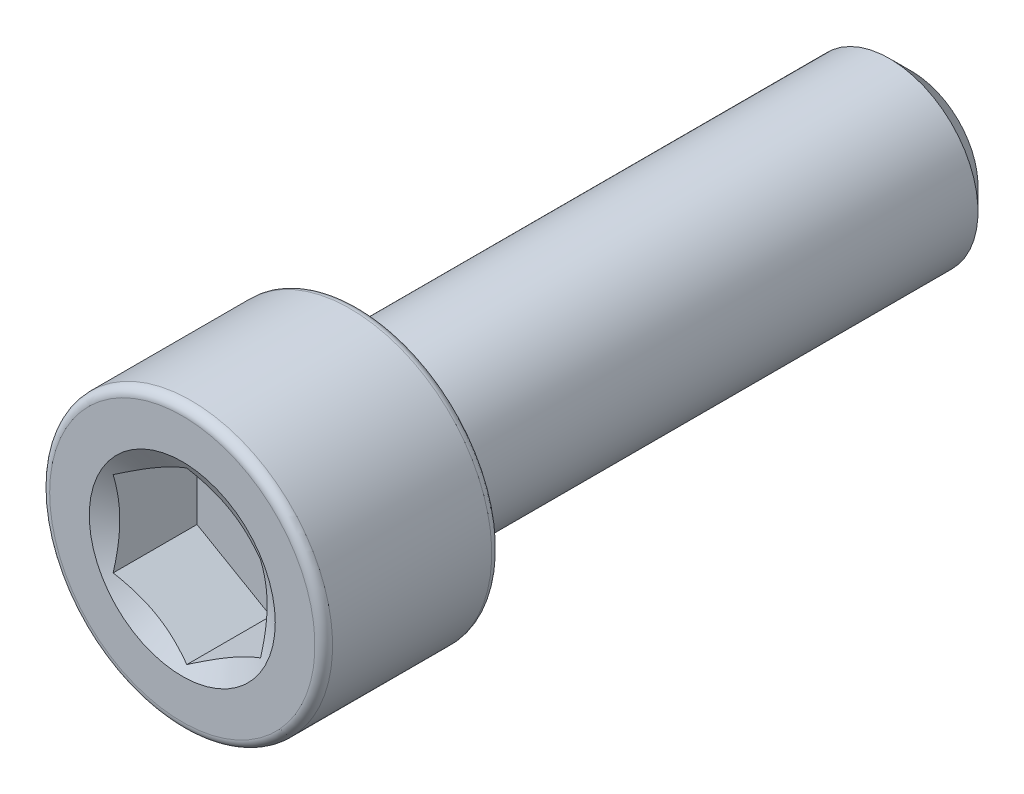
ISO-10303-21;
HEADER;
FILE_DESCRIPTION(('STEP AP214'),'2;1');
FILE_NAME('part.step','',(''),(''),'','','');
FILE_SCHEMA(('AUTOMOTIVE_DESIGN { 1 0 10303 214 1 1 1 1 }'));
ENDSEC;
DATA;
#1=APPLICATION_CONTEXT('core data for automotive mechanical design processes');
#2=APPLICATION_PROTOCOL_DEFINITION('international standard','automotive_design',2000,#1);
#3=PRODUCT_CONTEXT('',#1,'mechanical');
#4=PRODUCT('Part','Part','',(#3));
#5=PRODUCT_RELATED_PRODUCT_CATEGORY('part','',(#4));
#6=PRODUCT_DEFINITION_FORMATION('','',#4);
#7=PRODUCT_DEFINITION_CONTEXT('part definition',#1,'design');
#8=PRODUCT_DEFINITION('design','',#6,#7);
#9=PRODUCT_DEFINITION_SHAPE('','',#8);
#10=(LENGTH_UNIT() NAMED_UNIT(*) SI_UNIT(.MILLI.,.METRE.));
#11=(NAMED_UNIT(*) PLANE_ANGLE_UNIT() SI_UNIT($,.RADIAN.));
#12=(NAMED_UNIT(*) SI_UNIT($,.STERADIAN.) SOLID_ANGLE_UNIT());
#13=UNCERTAINTY_MEASURE_WITH_UNIT(LENGTH_MEASURE(1.E-05),#10,'distance_accuracy_value','');
#14=(GEOMETRIC_REPRESENTATION_CONTEXT(3) GLOBAL_UNCERTAINTY_ASSIGNED_CONTEXT((#13)) GLOBAL_UNIT_ASSIGNED_CONTEXT((#10,
#11,#12)) REPRESENTATION_CONTEXT('',''));
#15=CARTESIAN_POINT('',(0.,0.,0.));
#16=DIRECTION('',(0.,0.,1.));
#17=DIRECTION('',(1.,0.,0.));
#18=AXIS2_PLACEMENT_3D('',#15,#16,#17);
#19=CARTESIAN_POINT('',(0.,0.,-3.14325));
#20=DIRECTION('',(0.,0.,-1.));
#21=DIRECTION('',(-1.,0.,0.));
#22=AXIS2_PLACEMENT_3D('',#19,#20,#21);
#23=PLANE('',#22);
#24=CARTESIAN_POINT('',(0.,0.,-3.14325));
#25=DIRECTION('',(0.,0.,-1.));
#26=DIRECTION('',(-1.,0.,0.));
#27=AXIS2_PLACEMENT_3D('',#24,#25,#26);
#28=CIRCLE('',#27,0.571500000000006);
#29=CARTESIAN_POINT('',(-0.571500000000006,0.,-3.14325));
#30=VERTEX_POINT('',#29);
#31=EDGE_CURVE('E57',#30,#30,#28,.T.);
#32=ORIENTED_EDGE('',*,*,#31,.T.);
#33=EDGE_LOOP('',(#32));
#34=FACE_BOUND('',#33,.T.);
#35=ADVANCED_FACE('F43',(#34),#23,.T.);
#36=CARTESIAN_POINT('',(0.,0.,-3.14325));
#37=DIRECTION('',(0.,0.,1.));
#38=DIRECTION('',(1.,0.,0.));
#39=AXIS2_PLACEMENT_3D('',#36,#37,#38);
#40=CONICAL_SURFACE('',#39,0.571500000000006,0.785398163397453);
#41=CARTESIAN_POINT('',(0.,0.,-2.95275));
#42=DIRECTION('',(0.,0.,-1.));
#43=DIRECTION('',(-1.,0.,0.));
#44=AXIS2_PLACEMENT_3D('',#41,#42,#43);
#45=CIRCLE('',#44,0.762000000000007);
#46=CARTESIAN_POINT('',(-0.762000000000007,0.,-2.95275));
#47=VERTEX_POINT('',#46);
#48=EDGE_CURVE('E151',#47,#47,#45,.T.);
#49=ORIENTED_EDGE('',*,*,#48,.T.);
#50=EDGE_LOOP('',(#49));
#51=FACE_BOUND('',#50,.T.);
#52=ORIENTED_EDGE('',*,*,#31,.F.);
#53=EDGE_LOOP('',(#52));
#54=FACE_BOUND('',#53,.T.);
#55=ADVANCED_FACE('F159',(#51,#54),#40,.T.);
#56=CARTESIAN_POINT('',(0.,0.,-3.14325));
#57=DIRECTION('',(0.,0.,-1.));
#58=DIRECTION('',(-1.,0.,0.));
#59=AXIS2_PLACEMENT_3D('',#56,#57,#58);
#60=CYLINDRICAL_SURFACE('',#59,0.762000000000007);
#61=CARTESIAN_POINT('',(0.,0.,1.61925));
#62=DIRECTION('',(0.,0.,-1.));
#63=DIRECTION('',(-1.,0.,0.));
#64=AXIS2_PLACEMENT_3D('',#61,#62,#63);
#65=CIRCLE('',#64,0.762000000000007);
#66=CARTESIAN_POINT('',(-0.762000000000007,0.,1.61925));
#67=VERTEX_POINT('',#66);
#68=EDGE_CURVE('E147',#67,#67,#65,.T.);
#69=ORIENTED_EDGE('',*,*,#68,.T.);
#70=EDGE_LOOP('',(#69));
#71=FACE_BOUND('',#70,.T.);
#72=ORIENTED_EDGE('',*,*,#48,.F.);
#73=EDGE_LOOP('',(#72));
#74=FACE_BOUND('',#73,.T.);
#75=ADVANCED_FACE('F161',(#71,#74),#60,.T.);
#76=CARTESIAN_POINT('',(0.,0.762000000000004,1.61925));
#77=DIRECTION('',(0.,0.,-1.));
#78=DIRECTION('',(-1.,0.,0.));
#79=AXIS2_PLACEMENT_3D('',#76,#77,#78);
#80=PLANE('',#79);
#81=CARTESIAN_POINT('',(0.,0.,1.61925));
#82=DIRECTION('',(0.,0.,-1.));
#83=DIRECTION('',(-1.,0.,0.));
#84=AXIS2_PLACEMENT_3D('',#81,#82,#83);
#85=CIRCLE('',#84,1.143);
#86=CARTESIAN_POINT('',(-1.143,0.,1.61925));
#87=VERTEX_POINT('',#86);
#88=EDGE_CURVE('E143',#87,#87,#85,.T.);
#89=ORIENTED_EDGE('',*,*,#88,.T.);
#90=EDGE_LOOP('',(#89));
#91=FACE_BOUND('',#90,.T.);
#92=ORIENTED_EDGE('',*,*,#68,.F.);
#93=EDGE_LOOP('',(#92));
#94=FACE_BOUND('',#93,.T.);
#95=ADVANCED_FACE('F168',(#91,#94),#80,.T.);
#96=CARTESIAN_POINT('',(0.,0.,1.69545));
#97=DIRECTION('',(0.,0.,-1.));
#98=DIRECTION('',(-1.,0.,0.));
#99=AXIS2_PLACEMENT_3D('',#96,#97,#98);
#100=TOROIDAL_SURFACE('',#99,1.143,0.0762000000000002);
#101=CARTESIAN_POINT('',(0.,0.,1.69545));
#102=DIRECTION('',(0.,0.,-1.));
#103=DIRECTION('',(-1.,0.,0.));
#104=AXIS2_PLACEMENT_3D('',#101,#102,#103);
#105=CIRCLE('',#104,1.2192);
#106=CARTESIAN_POINT('',(-1.2192,0.,1.69545));
#107=VERTEX_POINT('',#106);
#108=EDGE_CURVE('E139',#107,#107,#105,.T.);
#109=ORIENTED_EDGE('',*,*,#108,.T.);
#110=EDGE_LOOP('',(#109));
#111=FACE_BOUND('',#110,.T.);
#112=ORIENTED_EDGE('',*,*,#88,.F.);
#113=EDGE_LOOP('',(#112));
#114=FACE_BOUND('',#113,.T.);
#115=ADVANCED_FACE('F174',(#111,#114),#100,.T.);
#116=CARTESIAN_POINT('',(0.,0.,-3.14325));
#117=DIRECTION('',(0.,0.,-1.));
#118=DIRECTION('',(-1.,0.,0.));
#119=AXIS2_PLACEMENT_3D('',#116,#117,#118);
#120=CYLINDRICAL_SURFACE('',#119,1.2192);
#121=CARTESIAN_POINT('',(0.,0.,3.06705));
#122=DIRECTION('',(0.,0.,-1.));
#123=DIRECTION('',(-1.,0.,0.));
#124=AXIS2_PLACEMENT_3D('',#121,#122,#123);
#125=CIRCLE('',#124,1.2192);
#126=CARTESIAN_POINT('',(-1.2192,0.,3.06705));
#127=VERTEX_POINT('',#126);
#128=EDGE_CURVE('E135',#127,#127,#125,.T.);
#129=ORIENTED_EDGE('',*,*,#128,.T.);
#130=EDGE_LOOP('',(#129));
#131=FACE_BOUND('',#130,.T.);
#132=ORIENTED_EDGE('',*,*,#108,.F.);
#133=EDGE_LOOP('',(#132));
#134=FACE_BOUND('',#133,.T.);
#135=ADVANCED_FACE('F178',(#131,#134),#120,.T.);
#136=CARTESIAN_POINT('',(0.,0.,3.06705));
#137=DIRECTION('',(0.,0.,-1.));
#138=DIRECTION('',(-1.,0.,0.));
#139=AXIS2_PLACEMENT_3D('',#136,#137,#138);
#140=TOROIDAL_SURFACE('',#139,1.143,0.0761999999999994);
#141=CARTESIAN_POINT('',(0.,0.,3.14325));
#142=DIRECTION('',(0.,0.,-1.));
#143=DIRECTION('',(-1.,0.,0.));
#144=AXIS2_PLACEMENT_3D('',#141,#142,#143);
#145=CIRCLE('',#144,1.143);
#146=CARTESIAN_POINT('',(-1.143,0.,3.14325));
#147=VERTEX_POINT('',#146);
#148=EDGE_CURVE('E131',#147,#147,#145,.T.);
#149=ORIENTED_EDGE('',*,*,#148,.T.);
#150=EDGE_LOOP('',(#149));
#151=FACE_BOUND('',#150,.T.);
#152=ORIENTED_EDGE('',*,*,#128,.F.);
#153=EDGE_LOOP('',(#152));
#154=FACE_BOUND('',#153,.T.);
#155=ADVANCED_FACE('F182',(#151,#154),#140,.T.);
#156=CARTESIAN_POINT('',(0.,1.143,3.14325));
#157=DIRECTION('',(0.,0.,1.));
#158=DIRECTION('',(1.,0.,0.));
#159=AXIS2_PLACEMENT_3D('',#156,#157,#158);
#160=PLANE('',#159);
#161=CARTESIAN_POINT('',(0.,0.,3.14325));
#162=DIRECTION('',(0.,0.,1.));
#163=DIRECTION('',(1.,0.,0.));
#164=AXIS2_PLACEMENT_3D('',#161,#162,#163);
#165=CIRCLE('',#164,0.80152903489235);
#166=CARTESIAN_POINT('',(0.80152903489235,0.,3.14325));
#167=VERTEX_POINT('',#166);
#168=EDGE_CURVE('E290',#167,#167,#165,.T.);
#169=ORIENTED_EDGE('',*,*,#168,.F.);
#170=EDGE_LOOP('',(#169));
#171=FACE_BOUND('',#170,.T.);
#172=ORIENTED_EDGE('',*,*,#148,.F.);
#173=EDGE_LOOP('',(#172));
#174=FACE_BOUND('',#173,.T.);
#175=ADVANCED_FACE('F186',(#171,#174),#160,.T.);
#176=CARTESIAN_POINT('',(0.,0.,3.14325));
#177=DIRECTION('',(0.,0.,1.));
#178=DIRECTION('',(1.,0.,0.));
#179=AXIS2_PLACEMENT_3D('',#176,#177,#178);
#180=CONICAL_SURFACE('',#179,0.80152903489235,1.0471975511966);
#181=ORIENTED_EDGE('',*,*,#168,.T.);
#182=EDGE_LOOP('',(#181));
#183=FACE_BOUND('',#182,.T.);
#184=CARTESIAN_POINT('',(0.635199999999996,0.366501950881572,3.10388701168715));
#185=CARTESIAN_POINT('',(0.607292219657765,0.382614515374644,3.09457737100847));
#186=CARTESIAN_POINT('',(0.579143547529669,0.398866158805131,3.08610990429231));
#187=CARTESIAN_POINT('',(0.522358552704207,0.431650990853543,3.07132827647694));
#188=CARTESIAN_POINT('',(0.493721219336989,0.448184762981979,3.06501934730768));
#189=CARTESIAN_POINT('',(0.436801541446144,0.481047354334446,3.05519641810381));
#190=CARTESIAN_POINT('',(0.408527966055241,0.497371110697337,3.05161707793994));
#191=CARTESIAN_POINT('',(0.351847454758901,0.530095619152084,3.04734034979042));
#192=CARTESIAN_POINT('',(0.323440725531533,0.546496251918302,3.04663942426613));
#193=CARTESIAN_POINT('',(0.270330144468172,0.577159660192051,3.04808054129889));
#194=CARTESIAN_POINT('',(0.245618453518768,0.59142696161382,3.04986963645016));
#195=CARTESIAN_POINT('',(0.196374723541005,0.619857842372383,3.05554348317702));
#196=CARTESIAN_POINT('',(0.17184271734793,0.634021402751717,3.05942860854846));
#197=CARTESIAN_POINT('',(0.122506087540727,0.662505919251814,3.06914421243503));
#198=CARTESIAN_POINT('',(0.0977078290775989,0.676823200450935,3.07501666381184));
#199=CARTESIAN_POINT('',(0.0484816480053033,0.705243949344202,3.08834563129952));
#200=CARTESIAN_POINT('',(0.0240530923717906,0.719347782515125,3.09579900576742));
#201=CARTESIAN_POINT('',(-0.000200000000000831,0.733350311924659,3.10388701168715));
#202=B_SPLINE_CURVE_WITH_KNOTS('',3,(#184,#185,#186,#187,#188,#189,#190,#191,#192,#193,#194,
#195,#196,#197,#198,#199,#200,#201),.UNSPECIFIED.,.F.,.F.,(4,2,2,2,2,2,2,2,4),(0.,
0.100668399227339,0.201579101133731,0.299991033708959,0.398281982883151,0.483972077511034,
0.569677458748181,0.657319406154946,0.744788794625029),.UNSPECIFIED.);
#203=CARTESIAN_POINT('',(0.634999999999996,0.36661742093541,3.10382032927493));
#204=VERTEX_POINT('',#203);
#205=CARTESIAN_POINT('',(0.,0.733234841870821,3.10382032927493));
#206=VERTEX_POINT('',#205);
#207=EDGE_CURVE('E112',#204,#206,#202,.T.);
#208=ORIENTED_EDGE('',*,*,#207,.F.);
#209=CARTESIAN_POINT('',(0.634999999999996,-0.959097963112756,3.34458887137113));
#210=CARTESIAN_POINT('',(0.634999999999996,-0.931556679772268,3.33133288640638));
#211=CARTESIAN_POINT('',(0.634999999999996,-0.903949682605684,3.31821404780037));
#212=CARTESIAN_POINT('',(0.634999999999996,-0.848568245938541,3.29232241272994));
#213=CARTESIAN_POINT('',(0.634999999999996,-0.820793778244026,3.27954967664044));
#214=CARTESIAN_POINT('',(0.634999999999996,-0.736852988216084,3.24171797820004));
#215=CARTESIAN_POINT('',(0.634999999999996,-0.680391212596161,3.21730259930656));
#216=CARTESIAN_POINT('',(0.634999999999996,-0.564791122147835,3.17053996650527));
#217=CARTESIAN_POINT('',(0.634999999999996,-0.505621907681889,3.14826809758868));
#218=CARTESIAN_POINT('',(0.634999999999996,-0.385762189538681,3.1085231285872));
#219=CARTESIAN_POINT('',(0.634999999999996,-0.32507598228835,3.09103785327421));
#220=CARTESIAN_POINT('',(0.634999999999996,-0.23288430895413,3.07064278157229));
#221=CARTESIAN_POINT('',(0.634999999999996,-0.202030496197413,3.06482313217936));
#222=CARTESIAN_POINT('',(0.634999999999996,-0.139966950698752,3.05550634370196));
#223=CARTESIAN_POINT('',(0.634999999999996,-0.108757245471978,3.05200902629248));
#224=CARTESIAN_POINT('',(0.634999999999996,-0.0465339716075323,3.04766092799307));
#225=CARTESIAN_POINT('',(0.634999999999996,-0.0155226986376008,3.04677818467235));
#226=CARTESIAN_POINT('',(0.634999999999996,0.0464618478782128,3.04764819847805));
#227=CARTESIAN_POINT('',(0.634999999999996,0.0774351191960265,3.04940110337632));
#228=CARTESIAN_POINT('',(0.634999999999996,0.15331354471637,3.05676925154506));
#229=CARTESIAN_POINT('',(0.634999999999996,0.198082738302702,3.06378881381357));
#230=CARTESIAN_POINT('',(0.634999999999996,0.286762922650733,3.08203660362331));
#231=CARTESIAN_POINT('',(0.634999999999996,0.330672833400381,3.09326980933956));
#232=CARTESIAN_POINT('',(0.634999999999996,0.418574152667773,3.11903064980441));
#233=CARTESIAN_POINT('',(0.634999999999996,0.462544834049434,3.1336272080306));
#234=CARTESIAN_POINT('',(0.634999999999996,0.549675691693248,3.1649839540635));
#235=CARTESIAN_POINT('',(0.634999999999996,0.592836129832992,3.18174342850941));
#236=CARTESIAN_POINT('',(0.634999999999996,0.704311907635469,3.22726790844175));
#237=CARTESIAN_POINT('',(0.634999999999996,0.772148908745404,3.25719261535732));
#238=CARTESIAN_POINT('',(0.634999999999996,0.906823028330444,3.31921638383651));
#239=CARTESIAN_POINT('',(0.634999999999996,0.973659853784011,3.35131606794592));
#240=CARTESIAN_POINT('',(0.634999999999996,1.10674887456329,3.41690114886722));
#241=CARTESIAN_POINT('',(0.634999999999996,1.17300025710097,3.45038818857521));
#242=CARTESIAN_POINT('',(0.634999999999996,1.30505288297791,3.51823909978659));
#243=CARTESIAN_POINT('',(0.634999999999996,1.37085411045543,3.55260300198752));
#244=CARTESIAN_POINT('',(0.634999999999996,1.49574396602631,3.61855305353702));
#245=CARTESIAN_POINT('',(0.634999999999996,1.55486199449233,3.65008364721893));
#246=CARTESIAN_POINT('',(0.634999999999996,1.67290744925443,3.71350493414473));
#247=CARTESIAN_POINT('',(0.634999999999996,1.73183486761611,3.74539564213689));
#248=CARTESIAN_POINT('',(0.634999999999996,1.84938435294178,3.80935979658298));
#249=CARTESIAN_POINT('',(0.634999999999996,1.90800681480962,3.84143251816496));
#250=CARTESIAN_POINT('',(0.634999999999996,2.02513313038202,3.90578607052732));
#251=CARTESIAN_POINT('',(0.634999999999996,2.08363699060363,3.93806688944181));
#252=CARTESIAN_POINT('',(0.634999999999996,2.14209846807494,3.97042379632227));
#253=B_SPLINE_CURVE_WITH_KNOTS('',3,(#209,#210,#211,#212,#213,#214,#215,#216,#217,#218,#219,
#220,#221,#222,#223,#224,#225,#226,#227,#228,#229,#230,#231,#232,#233,#234,#235,#236,#237,#238,
#239,#240,#241,#242,#243,#244,#245,#246,#247,#248,#249,#250,#251,#252),.UNSPECIFIED.,.F.,.F.,(4,
2,2,2,2,2,2,2,2,2,2,2,2,2,2,2,2,2,2,2,2,4),(0.,0.0916947477036917,0.183405389195738,
0.367900985352525,0.557472775250362,0.746557790750754,0.84067915588981,0.934793292890921,
1.02775206288416,1.12071604495472,1.25638390103958,1.39221254825033,1.53112100835765,
1.66998377098744,1.892338586175,2.11475731727005,2.33744741687164,2.56014532321701,
2.76114638746783,2.96215571366433,3.16262288404548,3.36307872298072),.UNSPECIFIED.);
#254=CARTESIAN_POINT('',(0.634999999999996,-0.36661742093541,3.10382032927493));
#255=VERTEX_POINT('',#254);
#256=EDGE_CURVE('E232',#255,#204,#253,.T.);
#257=ORIENTED_EDGE('',*,*,#256,.F.);
#258=CARTESIAN_POINT('',(-0.000200000000001787,-0.733350311924659,3.10388701168715));
#259=CARTESIAN_POINT('',(0.0277077803422287,-0.717237747431588,3.09457737100847));
#260=CARTESIAN_POINT('',(0.0558564524703254,-0.700986104001101,3.08610990429231));
#261=CARTESIAN_POINT('',(0.112641447295787,-0.668201271952689,3.07132827647694));
#262=CARTESIAN_POINT('',(0.141278780663005,-0.651667499824252,3.06501934730768));
#263=CARTESIAN_POINT('',(0.19819845855385,-0.618804908471786,3.05519641810381));
#264=CARTESIAN_POINT('',(0.226472033944753,-0.602481152108895,3.05161707793994));
#265=CARTESIAN_POINT('',(0.283152545241094,-0.569756643654147,3.04734034979042));
#266=CARTESIAN_POINT('',(0.311559274468462,-0.553356010887929,3.04663942426613));
#267=CARTESIAN_POINT('',(0.364669855531822,-0.522692602614181,3.04808054129889));
#268=CARTESIAN_POINT('',(0.389381546481227,-0.508425301192411,3.04986963645016));
#269=CARTESIAN_POINT('',(0.43862527645899,-0.479994420433849,3.05554348317702));
#270=CARTESIAN_POINT('',(0.463157282652065,-0.465830860054515,3.05942860854846));
#271=CARTESIAN_POINT('',(0.512493912459268,-0.437346343554417,3.06914421243503));
#272=CARTESIAN_POINT('',(0.537292170922396,-0.423029062355296,3.07501666381184));
#273=CARTESIAN_POINT('',(0.586518351994692,-0.394608313462029,3.08834563129952));
#274=CARTESIAN_POINT('',(0.610946907628204,-0.380504480291107,3.09579900576742));
#275=CARTESIAN_POINT('',(0.635199999999996,-0.366501950881572,3.10388701168715));
#276=B_SPLINE_CURVE_WITH_KNOTS('',3,(#258,#259,#260,#261,#262,#263,#264,#265,#266,#267,#268,
#269,#270,#271,#272,#273,#274,#275),.UNSPECIFIED.,.F.,.F.,(4,2,2,2,2,2,2,2,4),(0.,
0.100668399227339,0.201579101133732,0.29999103370896,0.398281982883151,0.483972077511035,
0.569677458748182,0.657319406154947,0.74478879462503),.UNSPECIFIED.);
#277=CARTESIAN_POINT('',(0.,-0.733234841870821,3.10382032927493));
#278=VERTEX_POINT('',#277);
#279=EDGE_CURVE('E226',#278,#255,#276,.T.);
#280=ORIENTED_EDGE('',*,*,#279,.F.);
#281=CARTESIAN_POINT('',(-0.635199999999997,-0.366501950881574,3.10388701168715));
#282=CARTESIAN_POINT('',(-0.607292219657766,-0.382614515374645,3.09457737100847));
#283=CARTESIAN_POINT('',(-0.57914354752967,-0.398866158805133,3.08610990429231));
#284=CARTESIAN_POINT('',(-0.522358552704208,-0.431650990853544,3.07132827647694));
#285=CARTESIAN_POINT('',(-0.49372121933699,-0.448184762981981,3.06501934730768));
#286=CARTESIAN_POINT('',(-0.436801541446145,-0.481047354334447,3.05519641810381));
#287=CARTESIAN_POINT('',(-0.408527966055242,-0.497371110697338,3.05161707793994));
#288=CARTESIAN_POINT('',(-0.351847454758901,-0.530095619152086,3.04734034979043));
#289=CARTESIAN_POINT('',(-0.323440725531533,-0.546496251918304,3.04663942426614));
#290=CARTESIAN_POINT('',(-0.270330144468173,-0.577159660192052,3.04808054129889));
#291=CARTESIAN_POINT('',(-0.245618453518768,-0.591426961613822,3.04986963645016));
#292=CARTESIAN_POINT('',(-0.196374723541006,-0.619857842372384,3.05554348317702));
#293=CARTESIAN_POINT('',(-0.171842717347931,-0.634021402751717,3.05942860854846));
#294=CARTESIAN_POINT('',(-0.122506087540729,-0.662505919251815,3.06914421243503));
#295=CARTESIAN_POINT('',(-0.0977078290776008,-0.676823200450936,3.07501666381184));
#296=CARTESIAN_POINT('',(-0.0484816480053055,-0.705243949344203,3.08834563129952));
#297=CARTESIAN_POINT('',(-0.0240530923717929,-0.719347782515125,3.09579900576742));
#298=CARTESIAN_POINT('',(0.00019999999999821,-0.733350311924659,3.10388701168715));
#299=B_SPLINE_CURVE_WITH_KNOTS('',3,(#281,#282,#283,#284,#285,#286,#287,#288,#289,#290,#291,
#292,#293,#294,#295,#296,#297,#298),.UNSPECIFIED.,.F.,.F.,(4,2,2,2,2,2,2,2,4),(0.,
0.100668399227339,0.201579101133732,0.29999103370896,0.398281982883151,0.483972077511034,
0.56967745874818,0.657319406154945,0.744788794625027),.UNSPECIFIED.);
#300=CARTESIAN_POINT('',(-0.634999999999997,-0.366617420935412,3.10382032927493));
#301=VERTEX_POINT('',#300);
#302=EDGE_CURVE('E64',#301,#278,#299,.T.);
#303=ORIENTED_EDGE('',*,*,#302,.F.);
#304=CARTESIAN_POINT('',(-0.634999999999996,-0.959097963112759,3.34458887137113));
#305=CARTESIAN_POINT('',(-0.634999999999996,-0.931556679772271,3.33133288640638));
#306=CARTESIAN_POINT('',(-0.634999999999996,-0.903949682605686,3.31821404780037));
#307=CARTESIAN_POINT('',(-0.634999999999996,-0.848568245938543,3.29232241272994));
#308=CARTESIAN_POINT('',(-0.634999999999996,-0.820793778244028,3.27954967664044));
#309=CARTESIAN_POINT('',(-0.634999999999996,-0.736852988216085,3.24171797820004));
#310=CARTESIAN_POINT('',(-0.634999999999996,-0.680391212596162,3.21730259930656));
#311=CARTESIAN_POINT('',(-0.634999999999996,-0.564791122147836,3.17053996650527));
#312=CARTESIAN_POINT('',(-0.634999999999996,-0.50562190768189,3.14826809758868));
#313=CARTESIAN_POINT('',(-0.634999999999997,-0.385762189538682,3.1085231285872));
#314=CARTESIAN_POINT('',(-0.634999999999997,-0.325075982288351,3.09103785327421));
#315=CARTESIAN_POINT('',(-0.634999999999997,-0.232884308954131,3.07064278157229));
#316=CARTESIAN_POINT('',(-0.634999999999997,-0.202030496197414,3.06482313217936));
#317=CARTESIAN_POINT('',(-0.634999999999997,-0.139966950698752,3.05550634370196));
#318=CARTESIAN_POINT('',(-0.634999999999997,-0.108757245471978,3.05200902629249));
#319=CARTESIAN_POINT('',(-0.634999999999997,-0.0465339716075327,3.04766092799307));
#320=CARTESIAN_POINT('',(-0.634999999999997,-0.0155226986376012,3.04677818467235));
#321=CARTESIAN_POINT('',(-0.634999999999997,0.0464618478782125,3.04764819847805));
#322=CARTESIAN_POINT('',(-0.634999999999997,0.0774351191960263,3.04940110337633));
#323=CARTESIAN_POINT('',(-0.634999999999997,0.15331354471637,3.05676925154506));
#324=CARTESIAN_POINT('',(-0.634999999999997,0.198082738302703,3.06378881381357));
#325=CARTESIAN_POINT('',(-0.634999999999997,0.286762922650733,3.08203660362331));
#326=CARTESIAN_POINT('',(-0.634999999999998,0.330672833400382,3.09326980933956));
#327=CARTESIAN_POINT('',(-0.634999999999998,0.418574152667773,3.11903064980441));
#328=CARTESIAN_POINT('',(-0.634999999999998,0.462544834049434,3.1336272080306));
#329=CARTESIAN_POINT('',(-0.634999999999998,0.549675691693249,3.1649839540635));
#330=CARTESIAN_POINT('',(-0.634999999999998,0.592836129832993,3.18174342850942));
#331=CARTESIAN_POINT('',(-0.634999999999998,0.704311907635471,3.22726790844175));
#332=CARTESIAN_POINT('',(-0.634999999999998,0.772148908745406,3.25719261535732));
#333=CARTESIAN_POINT('',(-0.634999999999998,0.906823028330446,3.31921638383651));
#334=CARTESIAN_POINT('',(-0.634999999999998,0.973659853784013,3.35131606794592));
#335=CARTESIAN_POINT('',(-0.634999999999998,1.10674887456329,3.41690114886722));
#336=CARTESIAN_POINT('',(-0.634999999999999,1.17300025710097,3.45038818857521));
#337=CARTESIAN_POINT('',(-0.634999999999999,1.30505288297791,3.51823909978659));
#338=CARTESIAN_POINT('',(-0.634999999999999,1.37085411045543,3.55260300198752));
#339=CARTESIAN_POINT('',(-0.634999999999999,1.49574396602631,3.61855305353702));
#340=CARTESIAN_POINT('',(-0.634999999999999,1.55486199449233,3.65008364721893));
#341=CARTESIAN_POINT('',(-0.634999999999999,1.67290744925443,3.71350493414474));
#342=CARTESIAN_POINT('',(-0.634999999999999,1.73183486761611,3.74539564213689));
#343=CARTESIAN_POINT('',(-0.634999999999999,1.84938435294179,3.80935979658299));
#344=CARTESIAN_POINT('',(-0.634999999999999,1.90800681480962,3.84143251816497));
#345=CARTESIAN_POINT('',(-0.634999999999999,2.02513313038203,3.90578607052732));
#346=CARTESIAN_POINT('',(-0.634999999999999,2.08363699060363,3.93806688944181));
#347=CARTESIAN_POINT('',(-0.635,2.14209846807494,3.97042379632228));
#348=B_SPLINE_CURVE_WITH_KNOTS('',3,(#304,#305,#306,#307,#308,#309,#310,#311,#312,#313,#314,
#315,#316,#317,#318,#319,#320,#321,#322,#323,#324,#325,#326,#327,#328,#329,#330,#331,#332,#333,
#334,#335,#336,#337,#338,#339,#340,#341,#342,#343,#344,#345,#346,#347),.UNSPECIFIED.,.F.,.F.,(4,
2,2,2,2,2,2,2,2,2,2,2,2,2,2,2,2,2,2,2,2,4),(0.,0.0916947477036918,0.183405389195739,
0.367900985352527,0.557472775250364,0.746557790750756,0.840679155889812,0.934793292890923,
1.02775206288416,1.12071604495472,1.25638390103958,1.39221254825034,1.53112100835766,
1.66998377098745,1.89233858617501,2.11475731727006,2.33744741687165,2.56014532321702,
2.76114638746784,2.96215571366433,3.16262288404549,3.36307872298072),.UNSPECIFIED.);
#349=CARTESIAN_POINT('',(-0.634999999999998,0.366617420935411,3.10382032927493));
#350=VERTEX_POINT('',#349);
#351=EDGE_CURVE('E11',#350,#301,#348,.F.);
#352=ORIENTED_EDGE('',*,*,#351,.F.);
#353=CARTESIAN_POINT('',(0.000199999999999185,0.733350311924659,3.10388701168715));
#354=CARTESIAN_POINT('',(-0.0277077803422313,0.717237747431588,3.09457737100847));
#355=CARTESIAN_POINT('',(-0.055856452470328,0.700986104001101,3.08610990429231));
#356=CARTESIAN_POINT('',(-0.11264144729579,0.668201271952689,3.07132827647694));
#357=CARTESIAN_POINT('',(-0.141278780663008,0.651667499824252,3.06501934730768));
#358=CARTESIAN_POINT('',(-0.198198458553853,0.618804908471786,3.05519641810381));
#359=CARTESIAN_POINT('',(-0.226472033944756,0.602481152108895,3.05161707793994));
#360=CARTESIAN_POINT('',(-0.283152545241096,0.569756643654147,3.04734034979043));
#361=CARTESIAN_POINT('',(-0.311559274468465,0.55335601088793,3.04663942426614));
#362=CARTESIAN_POINT('',(-0.364669855531825,0.522692602614181,3.04808054129889));
#363=CARTESIAN_POINT('',(-0.389381546481229,0.508425301192411,3.04986963645016));
#364=CARTESIAN_POINT('',(-0.438625276458992,0.479994420433849,3.05554348317702));
#365=CARTESIAN_POINT('',(-0.463157282652067,0.465830860054516,3.05942860854846));
#366=CARTESIAN_POINT('',(-0.51249391245927,0.437346343554418,3.06914421243503));
#367=CARTESIAN_POINT('',(-0.537292170922398,0.423029062355297,3.07501666381184));
#368=CARTESIAN_POINT('',(-0.586518351994694,0.39460831346203,3.08834563129952));
#369=CARTESIAN_POINT('',(-0.610946907628206,0.380504480291108,3.09579900576742));
#370=CARTESIAN_POINT('',(-0.635199999999998,0.366501950881573,3.10388701168715));
#371=B_SPLINE_CURVE_WITH_KNOTS('',3,(#353,#354,#355,#356,#357,#358,#359,#360,#361,#362,#363,
#364,#365,#366,#367,#368,#369,#370),.UNSPECIFIED.,.F.,.F.,(4,2,2,2,2,2,2,2,4),(0.,
0.100668399227339,0.201579101133732,0.29999103370896,0.398281982883151,0.483972077511035,
0.569677458748181,0.657319406154946,0.744788794625029),.UNSPECIFIED.);
#372=EDGE_CURVE('E102',#206,#350,#371,.T.);
#373=ORIENTED_EDGE('',*,*,#372,.F.);
#374=EDGE_LOOP('',(#208,#257,#280,#303,#352,#373));
#375=FACE_BOUND('',#374,.T.);
#376=ADVANCED_FACE('F101',(#183,#375),#180,.F.);
#377=CARTESIAN_POINT('',(0.,0.,2.38125));
#378=DIRECTION('',(0.,0.,1.));
#379=DIRECTION('',(1.,0.,0.));
#380=AXIS2_PLACEMENT_3D('',#377,#378,#379);
#381=PLANE('',#380);
#382=DIRECTION('',(-0.866025403784439,-0.5,0.));
#383=VECTOR('',#382,1.);
#384=CARTESIAN_POINT('',(0.,0.733234841870821,2.38125));
#385=LINE('',#384,#383);
#386=CARTESIAN_POINT('',(0.,0.733234841870821,2.38125));
#387=VERTEX_POINT('',#386);
#388=CARTESIAN_POINT('',(-0.634999999999998,0.366617420935411,2.38125));
#389=VERTEX_POINT('',#388);
#390=EDGE_CURVE('E111',#387,#389,#385,.T.);
#391=ORIENTED_EDGE('',*,*,#390,.T.);
#392=DIRECTION('',(0.,-1.,0.));
#393=VECTOR('',#392,1.);
#394=CARTESIAN_POINT('',(-0.634999999999998,0.366617420935411,2.38125));
#395=LINE('',#394,#393);
#396=CARTESIAN_POINT('',(-0.634999999999997,-0.366617420935412,2.38125));
#397=VERTEX_POINT('',#396);
#398=EDGE_CURVE('E116',#389,#397,#395,.T.);
#399=ORIENTED_EDGE('',*,*,#398,.T.);
#400=DIRECTION('',(0.866025403784438,-0.5,0.));
#401=VECTOR('',#400,1.);
#402=CARTESIAN_POINT('',(-0.634999999999997,-0.366617420935412,2.38125));
#403=LINE('',#402,#401);
#404=CARTESIAN_POINT('',(0.,-0.733234841870821,2.38125));
#405=VERTEX_POINT('',#404);
#406=EDGE_CURVE('E259',#397,#405,#403,.T.);
#407=ORIENTED_EDGE('',*,*,#406,.T.);
#408=DIRECTION('',(0.866025403784438,0.5,0.));
#409=VECTOR('',#408,1.);
#410=CARTESIAN_POINT('',(0.,-0.733234841870821,2.38125));
#411=LINE('',#410,#409);
#412=CARTESIAN_POINT('',(0.634999999999996,-0.36661742093541,2.38125));
#413=VERTEX_POINT('',#412);
#414=EDGE_CURVE('E264',#405,#413,#411,.T.);
#415=ORIENTED_EDGE('',*,*,#414,.T.);
#416=DIRECTION('',(0.,1.,0.));
#417=VECTOR('',#416,1.);
#418=CARTESIAN_POINT('',(0.634999999999996,-0.36661742093541,2.38125));
#419=LINE('',#418,#417);
#420=CARTESIAN_POINT('',(0.634999999999996,0.36661742093541,2.38125));
#421=VERTEX_POINT('',#420);
#422=EDGE_CURVE('E127',#413,#421,#419,.T.);
#423=ORIENTED_EDGE('',*,*,#422,.T.);
#424=DIRECTION('',(-0.866025403784438,0.500000000000001,0.));
#425=VECTOR('',#424,1.);
#426=CARTESIAN_POINT('',(0.634999999999996,0.36661742093541,2.38125));
#427=LINE('',#426,#425);
#428=EDGE_CURVE('E120',#421,#387,#427,.T.);
#429=ORIENTED_EDGE('',*,*,#428,.T.);
#430=EDGE_LOOP('',(#391,#399,#407,#415,#423,#429));
#431=FACE_BOUND('',#430,.T.);
#432=ADVANCED_FACE('F212',(#431),#381,.T.);
#433=CARTESIAN_POINT('',(-0.634999999999998,0.366617420935411,2.38125));
#434=DIRECTION('',(-1.,0.,0.));
#435=DIRECTION('',(0.,-1.,0.));
#436=AXIS2_PLACEMENT_3D('',#433,#434,#435);
#437=PLANE('',#436);
#438=DIRECTION('',(0.,0.,1.));
#439=VECTOR('',#438,1.);
#440=CARTESIAN_POINT('',(-0.634999999999998,0.366617420935411,2.38125));
#441=LINE('',#440,#439);
#442=EDGE_CURVE('E108',#389,#350,#441,.T.);
#443=ORIENTED_EDGE('',*,*,#442,.T.);
#444=ORIENTED_EDGE('',*,*,#351,.T.);
#445=DIRECTION('',(0.,0.,1.));
#446=VECTOR('',#445,1.);
#447=CARTESIAN_POINT('',(-0.634999999999997,-0.366617420935412,2.38125));
#448=LINE('',#447,#446);
#449=EDGE_CURVE('E119',#397,#301,#448,.T.);
#450=ORIENTED_EDGE('',*,*,#449,.F.);
#451=ORIENTED_EDGE('',*,*,#398,.F.);
#452=EDGE_LOOP('',(#443,#444,#450,#451));
#453=FACE_BOUND('',#452,.T.);
#454=ADVANCED_FACE('F114',(#453),#437,.F.);
#455=CARTESIAN_POINT('',(-0.634999999999997,-0.366617420935412,2.38125));
#456=DIRECTION('',(-0.5,-0.866025403784438,0.));
#457=DIRECTION('',(0.866025403784439,-0.5,0.));
#458=AXIS2_PLACEMENT_3D('',#455,#456,#457);
#459=PLANE('',#458);
#460=ORIENTED_EDGE('',*,*,#449,.T.);
#461=ORIENTED_EDGE('',*,*,#302,.T.);
#462=DIRECTION('',(0.,0.,1.));
#463=VECTOR('',#462,1.);
#464=CARTESIAN_POINT('',(0.,-0.733234841870821,2.38125));
#465=LINE('',#464,#463);
#466=EDGE_CURVE('E124',#405,#278,#465,.T.);
#467=ORIENTED_EDGE('',*,*,#466,.F.);
#468=ORIENTED_EDGE('',*,*,#406,.F.);
#469=EDGE_LOOP('',(#460,#461,#467,#468));
#470=FACE_BOUND('',#469,.T.);
#471=ADVANCED_FACE('F248',(#470),#459,.F.);
#472=CARTESIAN_POINT('',(0.,-0.733234841870821,2.38125));
#473=DIRECTION('',(0.5,-0.866025403784438,0.));
#474=DIRECTION('',(0.866025403784439,0.5,0.));
#475=AXIS2_PLACEMENT_3D('',#472,#473,#474);
#476=PLANE('',#475);
#477=ORIENTED_EDGE('',*,*,#466,.T.);
#478=ORIENTED_EDGE('',*,*,#279,.T.);
#479=DIRECTION('',(0.,0.,1.));
#480=VECTOR('',#479,1.);
#481=CARTESIAN_POINT('',(0.634999999999996,-0.36661742093541,2.38125));
#482=LINE('',#481,#480);
#483=EDGE_CURVE('E280',#413,#255,#482,.T.);
#484=ORIENTED_EDGE('',*,*,#483,.F.);
#485=ORIENTED_EDGE('',*,*,#414,.F.);
#486=EDGE_LOOP('',(#477,#478,#484,#485));
#487=FACE_BOUND('',#486,.T.);
#488=ADVANCED_FACE('F243',(#487),#476,.F.);
#489=CARTESIAN_POINT('',(0.634999999999996,-0.36661742093541,2.38125));
#490=DIRECTION('',(1.,0.,0.));
#491=DIRECTION('',(0.,0.,-1.));
#492=AXIS2_PLACEMENT_3D('',#489,#490,#491);
#493=PLANE('',#492);
#494=ORIENTED_EDGE('',*,*,#483,.T.);
#495=ORIENTED_EDGE('',*,*,#256,.T.);
#496=DIRECTION('',(0.,0.,1.));
#497=VECTOR('',#496,1.);
#498=CARTESIAN_POINT('',(0.634999999999996,0.36661742093541,2.38125));
#499=LINE('',#498,#497);
#500=EDGE_CURVE('E276',#421,#204,#499,.T.);
#501=ORIENTED_EDGE('',*,*,#500,.F.);
#502=ORIENTED_EDGE('',*,*,#422,.F.);
#503=EDGE_LOOP('',(#494,#495,#501,#502));
#504=FACE_BOUND('',#503,.T.);
#505=ADVANCED_FACE('F240',(#504),#493,.F.);
#506=CARTESIAN_POINT('',(0.634999999999996,0.36661742093541,2.38125));
#507=DIRECTION('',(0.500000000000001,0.866025403784438,0.));
#508=DIRECTION('',(-0.866025403784438,0.500000000000001,0.));
#509=AXIS2_PLACEMENT_3D('',#506,#507,#508);
#510=PLANE('',#509);
#511=ORIENTED_EDGE('',*,*,#500,.T.);
#512=ORIENTED_EDGE('',*,*,#207,.T.);
#513=DIRECTION('',(0.,0.,1.));
#514=VECTOR('',#513,1.);
#515=CARTESIAN_POINT('',(0.,0.733234841870821,2.38125));
#516=LINE('',#515,#514);
#517=EDGE_CURVE('E71',#387,#206,#516,.T.);
#518=ORIENTED_EDGE('',*,*,#517,.F.);
#519=ORIENTED_EDGE('',*,*,#428,.F.);
#520=EDGE_LOOP('',(#511,#512,#518,#519));
#521=FACE_BOUND('',#520,.T.);
#522=ADVANCED_FACE('F193',(#521),#510,.F.);
#523=CARTESIAN_POINT('',(0.,0.733234841870821,2.38125));
#524=DIRECTION('',(-0.5,0.866025403784439,0.));
#525=DIRECTION('',(-0.866025403784439,-0.5,0.));
#526=AXIS2_PLACEMENT_3D('',#523,#524,#525);
#527=PLANE('',#526);
#528=ORIENTED_EDGE('',*,*,#517,.T.);
#529=ORIENTED_EDGE('',*,*,#372,.T.);
#530=ORIENTED_EDGE('',*,*,#442,.F.);
#531=ORIENTED_EDGE('',*,*,#390,.F.);
#532=EDGE_LOOP('',(#528,#529,#530,#531));
#533=FACE_BOUND('',#532,.T.);
#534=ADVANCED_FACE('F107',(#533),#527,.F.);
#535=CLOSED_SHELL('',(#35,#55,#75,#95,#115,#135,#155,#175,#376,#432,#454,#471,#488,#505,#522,#534));
#536=MANIFOLD_SOLID_BREP('B2',#535);
#537=ADVANCED_BREP_SHAPE_REPRESENTATION('',(#18,#536),#14);
#538=SHAPE_DEFINITION_REPRESENTATION(#9,#537);
ENDSEC;
END-ISO-10303-21;
